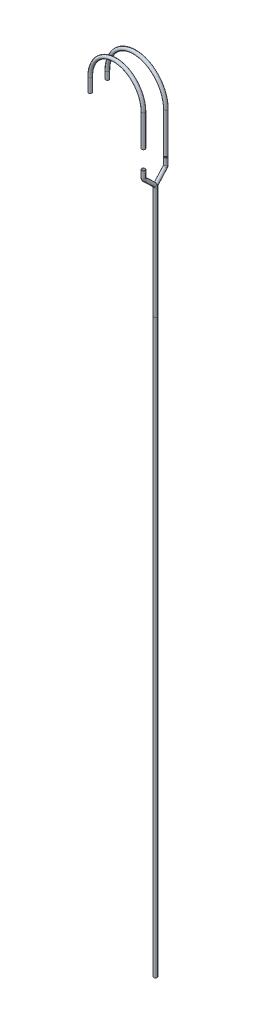
ISO-10303-21;
HEADER;
FILE_DESCRIPTION(('STEP AP214'),'2;1');
FILE_NAME('part.step','',(''),(''),'','','');
FILE_SCHEMA(('AUTOMOTIVE_DESIGN { 1 0 10303 214 1 1 1 1 }'));
ENDSEC;
DATA;
#1=APPLICATION_CONTEXT('core data for automotive mechanical design processes');
#2=APPLICATION_PROTOCOL_DEFINITION('international standard','automotive_design',2000,#1);
#3=PRODUCT_CONTEXT('',#1,'mechanical');
#4=PRODUCT('Part','Part','',(#3));
#5=PRODUCT_RELATED_PRODUCT_CATEGORY('part','',(#4));
#6=PRODUCT_DEFINITION_FORMATION('','',#4);
#7=PRODUCT_DEFINITION_CONTEXT('part definition',#1,'design');
#8=PRODUCT_DEFINITION('design','',#6,#7);
#9=PRODUCT_DEFINITION_SHAPE('','',#8);
#10=(LENGTH_UNIT() NAMED_UNIT(*) SI_UNIT(.MILLI.,.METRE.));
#11=(NAMED_UNIT(*) PLANE_ANGLE_UNIT() SI_UNIT($,.RADIAN.));
#12=(NAMED_UNIT(*) SI_UNIT($,.STERADIAN.) SOLID_ANGLE_UNIT());
#13=UNCERTAINTY_MEASURE_WITH_UNIT(LENGTH_MEASURE(1.E-05),#10,'distance_accuracy_value','');
#14=(GEOMETRIC_REPRESENTATION_CONTEXT(3) GLOBAL_UNCERTAINTY_ASSIGNED_CONTEXT((#13)) GLOBAL_UNIT_ASSIGNED_CONTEXT((#10,
#11,#12)) REPRESENTATION_CONTEXT('',''));
#15=CARTESIAN_POINT('',(0.,0.,0.));
#16=DIRECTION('',(0.,0.,1.));
#17=DIRECTION('',(1.,0.,0.));
#18=AXIS2_PLACEMENT_3D('',#15,#16,#17);
#19=CARTESIAN_POINT('',(-29328.0283187605,8249.09082358546,41599.5844884566));
#20=DIRECTION('',(0.,-1.,0.));
#21=DIRECTION('',(-0.138416963264837,0.,0.990374042612457));
#22=AXIS2_PLACEMENT_3D('',#19,#20,#21);
#23=PLANE('',#22);
#24=CARTESIAN_POINT('',(-29328.0283187605,8249.09082358546,41599.5844884566));
#25=DIRECTION('',(0.,-1.,0.));
#26=DIRECTION('',(0.,0.,-1.));
#27=AXIS2_PLACEMENT_3D('',#24,#25,#26);
#28=CIRCLE('',#27,27.0000000000011);
#29=CARTESIAN_POINT('',(-29328.0283187605,8249.09082358546,41572.5844884566));
#30=VERTEX_POINT('',#29);
#31=EDGE_CURVE('E123',#30,#30,#28,.T.);
#32=ORIENTED_EDGE('',*,*,#31,.F.);
#33=EDGE_LOOP('',(#32));
#34=FACE_BOUND('',#33,.T.);
#35=CARTESIAN_POINT('',(-29328.0283187605,8249.09082358546,41599.5844884566));
#36=DIRECTION('',(0.,-1.,0.));
#37=DIRECTION('',(-0.138416963264837,0.,0.990374042612457));
#38=AXIS2_PLACEMENT_3D('',#35,#36,#37);
#39=CIRCLE('',#38,30.0000000000011);
#40=CARTESIAN_POINT('',(-29332.1808276585,8249.09082358546,41629.295709735));
#41=VERTEX_POINT('',#40);
#42=EDGE_CURVE('E114',#41,#41,#39,.T.);
#43=ORIENTED_EDGE('',*,*,#42,.T.);
#44=EDGE_LOOP('',(#43));
#45=FACE_BOUND('',#44,.T.);
#46=ADVANCED_FACE('F100',(#34,#45),#23,.T.);
#47=CARTESIAN_POINT('',(-30449.0264801453,8827.27610677791,41521.6266986129));
#48=DIRECTION('',(0.,1.,0.));
#49=DIRECTION('',(0.,0.,1.));
#50=AXIS2_PLACEMENT_3D('',#47,#48,#49);
#51=PLANE('',#50);
#52=CARTESIAN_POINT('',(-30449.0264801453,8827.27610677791,41521.6266986129));
#53=DIRECTION('',(0.,1.,0.));
#54=DIRECTION('',(0.,0.,1.));
#55=AXIS2_PLACEMENT_3D('',#52,#53,#54);
#56=CIRCLE('',#55,27.0000000000011);
#57=CARTESIAN_POINT('',(-30449.0264801453,8827.27610677791,41548.6266986129));
#58=VERTEX_POINT('',#57);
#59=EDGE_CURVE('E119',#58,#58,#56,.T.);
#60=ORIENTED_EDGE('',*,*,#59,.T.);
#61=EDGE_LOOP('',(#60));
#62=FACE_BOUND('',#61,.T.);
#63=CARTESIAN_POINT('',(-30449.0264801453,8827.27610677791,41521.6266986129));
#64=DIRECTION('',(0.,1.,0.));
#65=DIRECTION('',(0.,0.,1.));
#66=AXIS2_PLACEMENT_3D('',#63,#64,#65);
#67=CIRCLE('',#66,30.0000000000011);
#68=CARTESIAN_POINT('',(-30449.0264801453,8827.27610677791,41551.6266986129));
#69=VERTEX_POINT('',#68);
#70=EDGE_CURVE('E12',#69,#69,#67,.T.);
#71=ORIENTED_EDGE('',*,*,#70,.F.);
#72=EDGE_LOOP('',(#71));
#73=FACE_BOUND('',#72,.T.);
#74=ADVANCED_FACE('F143',(#62,#73),#51,.F.);
#75=CARTESIAN_POINT('',(-29328.0283187605,8249.09082358546,41599.5844884566));
#76=DIRECTION('',(0.,1.,0.));
#77=DIRECTION('',(0.,0.,1.));
#78=AXIS2_PLACEMENT_3D('',#75,#76,#77);
#79=CYLINDRICAL_SURFACE('',#78,30.0000000000011);
#80=CARTESIAN_POINT('',(-29328.0283187605,8963.28672199971,41599.5844884566));
#81=DIRECTION('',(0.,-1.,0.));
#82=DIRECTION('',(-0.138416963264837,0.,0.990374042612457));
#83=AXIS2_PLACEMENT_3D('',#80,#81,#82);
#84=CIRCLE('',#83,30.0000000000011);
#85=CARTESIAN_POINT('',(-29298.1006005184,8963.28672199971,41601.6657574984));
#86=VERTEX_POINT('',#85);
#87=EDGE_CURVE('E110',#86,#86,#84,.T.);
#88=ORIENTED_EDGE('',*,*,#87,.T.);
#89=EDGE_LOOP('',(#88));
#90=FACE_BOUND('',#89,.T.);
#91=ORIENTED_EDGE('',*,*,#42,.F.);
#92=EDGE_LOOP('',(#91));
#93=FACE_BOUND('',#92,.T.);
#94=ADVANCED_FACE('F147',(#90,#93),#79,.T.);
#95=CARTESIAN_POINT('',(-29888.5273994529,8963.28672199971,41560.6055935347));
#96=DIRECTION('',(-0.069375634726981,0.,0.997590608068374));
#97=DIRECTION('',(0.997590608068374,0.,0.069375634726981));
#98=AXIS2_PLACEMENT_3D('',#95,#96,#97);
#99=TOROIDAL_SURFACE('',#98,561.852804305876,30.0000000000011);
#100=CARTESIAN_POINT('',(-30449.0264801453,8963.28672199971,41521.6266986129));
#101=DIRECTION('',(0.,1.,0.));
#102=DIRECTION('',(0.,0.,1.));
#103=AXIS2_PLACEMENT_3D('',#100,#101,#102);
#104=CIRCLE('',#103,30.0000000000011);
#105=CARTESIAN_POINT('',(-30478.9541983874,8963.28672199971,41519.5454295711));
#106=VERTEX_POINT('',#105);
#107=EDGE_CURVE('E106',#106,#106,#104,.T.);
#108=CARTESIAN_POINT('',(-29888.5273994529,8963.28672199971,41560.6055935347));
#109=DIRECTION('',(-0.069375634726981,0.,0.997590608068374));
#110=DIRECTION('',(0.997590608068374,0.,0.069375634726981));
#111=AXIS2_PLACEMENT_3D('',#108,#109,#110);
#112=CIRCLE('',#111,591.852804305877);
#113=EDGE_CURVE('',#86,#106,#112,.T.);
#114=ORIENTED_EDGE('',*,*,#87,.F.);
#115=ORIENTED_EDGE('',*,*,#107,.T.);
#116=ORIENTED_EDGE('',*,*,#113,.T.);
#117=ORIENTED_EDGE('',*,*,#113,.F.);
#118=EDGE_LOOP('',(#114,#116,#115,#117));
#119=FACE_BOUND('',#118,.T.);
#120=ADVANCED_FACE('F149',(#119),#99,.T.);
#121=CARTESIAN_POINT('',(-30449.0264801453,8963.28672199971,41521.6266986129));
#122=DIRECTION('',(0.,-1.,0.));
#123=DIRECTION('',(0.,0.,-1.));
#124=AXIS2_PLACEMENT_3D('',#121,#122,#123);
#125=CYLINDRICAL_SURFACE('',#124,30.0000000000011);
#126=ORIENTED_EDGE('',*,*,#70,.T.);
#127=EDGE_LOOP('',(#126));
#128=FACE_BOUND('',#127,.T.);
#129=ORIENTED_EDGE('',*,*,#107,.F.);
#130=EDGE_LOOP('',(#129));
#131=FACE_BOUND('',#130,.T.);
#132=ADVANCED_FACE('F137',(#128,#131),#125,.T.);
#133=CARTESIAN_POINT('',(-29328.0283187605,8249.09082358546,41599.5844884566));
#134=DIRECTION('',(0.,1.,0.));
#135=DIRECTION('',(0.,0.,1.));
#136=AXIS2_PLACEMENT_3D('',#133,#134,#135);
#137=CYLINDRICAL_SURFACE('',#136,27.0000000000011);
#138=CARTESIAN_POINT('',(-29328.0283187605,8963.28672199971,41599.5844884566));
#139=DIRECTION('',(0.,1.,0.));
#140=DIRECTION('',(0.,0.,1.));
#141=AXIS2_PLACEMENT_3D('',#138,#139,#140);
#142=CIRCLE('',#141,27.0000000000011);
#143=CARTESIAN_POINT('',(-29301.0933723427,8963.28672199971,41601.4576305942));
#144=VERTEX_POINT('',#143);
#145=EDGE_CURVE('E126',#144,#144,#142,.F.);
#146=ORIENTED_EDGE('',*,*,#145,.F.);
#147=EDGE_LOOP('',(#146));
#148=FACE_BOUND('',#147,.T.);
#149=ORIENTED_EDGE('',*,*,#31,.T.);
#150=EDGE_LOOP('',(#149));
#151=FACE_BOUND('',#150,.T.);
#152=ADVANCED_FACE('F134',(#148,#151),#137,.F.);
#153=CARTESIAN_POINT('',(-29888.5273994529,8963.28672199971,41560.6055935347));
#154=DIRECTION('',(-0.069375634726981,0.,0.997590608068374));
#155=DIRECTION('',(0.997590608068374,0.,0.069375634726981));
#156=AXIS2_PLACEMENT_3D('',#153,#154,#155);
#157=TOROIDAL_SURFACE('',#156,561.852804305876,27.0000000000011);
#158=CARTESIAN_POINT('',(-30449.0264801453,8963.28672199971,41521.6266986129));
#159=DIRECTION('',(0.,1.,0.));
#160=DIRECTION('',(-1.,0.,0.));
#161=AXIS2_PLACEMENT_3D('',#158,#159,#160);
#162=CIRCLE('',#161,27.0000000000011);
#163=CARTESIAN_POINT('',(-30475.9614265632,8963.28672199971,41519.7535564752));
#164=VERTEX_POINT('',#163);
#165=EDGE_CURVE('E122',#164,#164,#162,.T.);
#166=CARTESIAN_POINT('',(-29888.5273994529,8963.28672199971,41560.6055935347));
#167=DIRECTION('',(-0.069375634726981,0.,0.997590608068374));
#168=DIRECTION('',(0.997590608068374,0.,0.069375634726981));
#169=AXIS2_PLACEMENT_3D('',#166,#167,#168);
#170=CIRCLE('',#169,588.852804305877);
#171=EDGE_CURVE('',#144,#164,#170,.T.);
#172=ORIENTED_EDGE('',*,*,#145,.T.);
#173=ORIENTED_EDGE('',*,*,#165,.F.);
#174=ORIENTED_EDGE('',*,*,#171,.T.);
#175=ORIENTED_EDGE('',*,*,#171,.F.);
#176=EDGE_LOOP('',(#172,#174,#173,#175));
#177=FACE_BOUND('',#176,.T.);
#178=ADVANCED_FACE('F132',(#177),#157,.F.);
#179=CARTESIAN_POINT('',(-30449.0264801453,8963.28672199971,41521.6266986129));
#180=DIRECTION('',(0.,-1.,0.));
#181=DIRECTION('',(0.,0.,-1.));
#182=AXIS2_PLACEMENT_3D('',#179,#180,#181);
#183=CYLINDRICAL_SURFACE('',#182,27.0000000000011);
#184=ORIENTED_EDGE('',*,*,#59,.F.);
#185=EDGE_LOOP('',(#184));
#186=FACE_BOUND('',#185,.T.);
#187=ORIENTED_EDGE('',*,*,#165,.T.);
#188=EDGE_LOOP('',(#187));
#189=FACE_BOUND('',#188,.T.);
#190=ADVANCED_FACE('F144',(#186,#189),#183,.F.);
#191=CLOSED_SHELL('',(#46,#74,#94,#120,#132,#152,#178,#190));
#192=MANIFOLD_SOLID_BREP('B2',#191);
#193=CARTESIAN_POINT('',(-29328.0283187605,8554.23850203513,41998.8335954096));
#194=DIRECTION('',(0.,-1.,0.));
#195=DIRECTION('',(0.990557061922177,0.,0.137101083424256));
#196=AXIS2_PLACEMENT_3D('',#193,#194,#195);
#197=PLANE('',#196);
#198=CARTESIAN_POINT('',(-29328.0283187605,8554.23850203513,41998.8335954096));
#199=DIRECTION('',(0.,-1.,0.));
#200=DIRECTION('',(1.,0.,0.));
#201=AXIS2_PLACEMENT_3D('',#198,#199,#200);
#202=CIRCLE('',#201,27.0000000000011);
#203=CARTESIAN_POINT('',(-29301.0283187605,8554.23850203513,41998.8335954096));
#204=VERTEX_POINT('',#203);
#205=EDGE_CURVE('E269',#204,#204,#202,.T.);
#206=ORIENTED_EDGE('',*,*,#205,.F.);
#207=EDGE_LOOP('',(#206));
#208=FACE_BOUND('',#207,.T.);
#209=CARTESIAN_POINT('',(-29328.0283187605,8554.23850203513,41998.8335954096));
#210=DIRECTION('',(0.,-1.,0.));
#211=DIRECTION('',(0.990557061922177,0.,0.137101083424256));
#212=AXIS2_PLACEMENT_3D('',#209,#210,#211);
#213=CIRCLE('',#212,30.0000000000011);
#214=CARTESIAN_POINT('',(-29298.3116069028,8554.23850203513,42002.9466279124));
#215=VERTEX_POINT('',#214);
#216=EDGE_CURVE('E260',#215,#215,#213,.T.);
#217=ORIENTED_EDGE('',*,*,#216,.T.);
#218=EDGE_LOOP('',(#217));
#219=FACE_BOUND('',#218,.T.);
#220=ADVANCED_FACE('F246',(#208,#219),#197,.T.);
#221=CARTESIAN_POINT('',(-30348.5713885513,8877.04012121745,41928.5429399818));
#222=DIRECTION('',(1.10862689605089E-12,1.,5.54313448025443E-13));
#223=DIRECTION('',(-1.,1.10862689605089E-12,0.));
#224=AXIS2_PLACEMENT_3D('',#221,#222,#223);
#225=PLANE('',#224);
#226=CARTESIAN_POINT('',(-30348.5713885513,8877.04012121745,41928.5429399818));
#227=DIRECTION('',(1.10862689605089E-12,1.,5.54313448025443E-13));
#228=DIRECTION('',(-1.,1.10862689605089E-12,0.));
#229=AXIS2_PLACEMENT_3D('',#226,#227,#228);
#230=CIRCLE('',#229,27.0000000000011);
#231=CARTESIAN_POINT('',(-30375.5713885513,8877.04012121748,41928.5429399818));
#232=VERTEX_POINT('',#231);
#233=EDGE_CURVE('E265',#232,#232,#230,.T.);
#234=ORIENTED_EDGE('',*,*,#233,.T.);
#235=EDGE_LOOP('',(#234));
#236=FACE_BOUND('',#235,.T.);
#237=CARTESIAN_POINT('',(-30348.5713885513,8877.04012121745,41928.5429399818));
#238=DIRECTION('',(1.10862689605089E-12,1.,5.54313448025443E-13));
#239=DIRECTION('',(-1.,1.10862689605089E-12,0.));
#240=AXIS2_PLACEMENT_3D('',#237,#238,#239);
#241=CIRCLE('',#240,30.0000000000011);
#242=CARTESIAN_POINT('',(-30378.5713885513,8877.04012121749,41928.5429399818));
#243=VERTEX_POINT('',#242);
#244=EDGE_CURVE('E99',#243,#243,#241,.T.);
#245=ORIENTED_EDGE('',*,*,#244,.F.);
#246=EDGE_LOOP('',(#245));
#247=FACE_BOUND('',#246,.T.);
#248=ADVANCED_FACE('F289',(#236,#247),#225,.F.);
#249=CARTESIAN_POINT('',(-29328.0283187605,8554.23850203513,41998.8335954096));
#250=DIRECTION('',(0.,1.,0.));
#251=DIRECTION('',(0.,0.,1.));
#252=AXIS2_PLACEMENT_3D('',#249,#250,#251);
#253=CYLINDRICAL_SURFACE('',#252,30.0000000000011);
#254=CARTESIAN_POINT('',(-29328.0283187605,9119.91561055123,41998.8335954096));
#255=DIRECTION('',(0.,-1.,0.));
#256=DIRECTION('',(0.990557061922177,0.,0.137101083424256));
#257=AXIS2_PLACEMENT_3D('',#254,#255,#256);
#258=CIRCLE('',#257,30.0000000000011);
#259=CARTESIAN_POINT('',(-29298.09922459,9119.91561055122,42000.8949838095));
#260=VERTEX_POINT('',#259);
#261=EDGE_CURVE('E256',#260,#260,#258,.T.);
#262=ORIENTED_EDGE('',*,*,#261,.T.);
#263=EDGE_LOOP('',(#262));
#264=FACE_BOUND('',#263,.T.);
#265=ORIENTED_EDGE('',*,*,#216,.F.);
#266=EDGE_LOOP('',(#265));
#267=FACE_BOUND('',#266,.T.);
#268=ADVANCED_FACE('F293',(#264,#267),#253,.T.);
#269=CARTESIAN_POINT('',(-29838.2998536558,9119.91561055125,41963.6882676958));
#270=DIRECTION('',(-0.0687129466615399,-4.93161917641324E-13,0.997636472349066));
#271=DIRECTION('',(0.997636472349066,0.,0.0687129466615399));
#272=AXIS2_PLACEMENT_3D('',#269,#270,#271);
#273=TOROIDAL_SURFACE('',#272,511.480433041648,30.0000000000011);
#274=CARTESIAN_POINT('',(-30348.5713885409,9119.9156105832,41928.5429399823));
#275=DIRECTION('',(1.10862689605089E-12,1.,5.54313448025443E-13));
#276=DIRECTION('',(-1.,1.10862689605089E-12,0.));
#277=AXIS2_PLACEMENT_3D('',#274,#275,#276);
#278=CIRCLE('',#277,30.0000000000011);
#279=CARTESIAN_POINT('',(-30378.5004827215,9119.91561058507,41926.4815515818));
#280=VERTEX_POINT('',#279);
#281=EDGE_CURVE('E252',#280,#280,#278,.T.);
#282=CARTESIAN_POINT('',(-29838.2998536558,9119.91561055125,41963.6882676958));
#283=DIRECTION('',(-0.0687129466615399,-4.93161917641324E-13,0.997636472349066));
#284=DIRECTION('',(0.997636472349066,0.,0.0687129466615399));
#285=AXIS2_PLACEMENT_3D('',#282,#283,#284);
#286=CIRCLE('',#285,541.480433041649);
#287=EDGE_CURVE('',#260,#280,#286,.T.);
#288=ORIENTED_EDGE('',*,*,#261,.F.);
#289=ORIENTED_EDGE('',*,*,#281,.T.);
#290=ORIENTED_EDGE('',*,*,#287,.T.);
#291=ORIENTED_EDGE('',*,*,#287,.F.);
#292=EDGE_LOOP('',(#288,#290,#289,#291));
#293=FACE_BOUND('',#292,.T.);
#294=ADVANCED_FACE('F295',(#293),#273,.T.);
#295=CARTESIAN_POINT('',(-30348.571388551,9119.91561055127,41928.5429399819));
#296=DIRECTION('',(-1.14096184718569E-12,-1.,-5.55853207603285E-13));
#297=DIRECTION('',(1.,-1.14096184718569E-12,0.));
#298=AXIS2_PLACEMENT_3D('',#295,#296,#297);
#299=CYLINDRICAL_SURFACE('',#298,30.0000000000011);
#300=ORIENTED_EDGE('',*,*,#244,.T.);
#301=EDGE_LOOP('',(#300));
#302=FACE_BOUND('',#301,.T.);
#303=ORIENTED_EDGE('',*,*,#281,.F.);
#304=EDGE_LOOP('',(#303));
#305=FACE_BOUND('',#304,.T.);
#306=ADVANCED_FACE('F283',(#302,#305),#299,.T.);
#307=CARTESIAN_POINT('',(-29328.0283187605,8554.23850203513,41998.8335954096));
#308=DIRECTION('',(0.,1.,0.));
#309=DIRECTION('',(0.,0.,1.));
#310=AXIS2_PLACEMENT_3D('',#307,#308,#309);
#311=CYLINDRICAL_SURFACE('',#310,27.0000000000011);
#312=CARTESIAN_POINT('',(-29328.0283187605,9119.91561055123,41998.8335954096));
#313=DIRECTION('',(0.,1.,0.));
#314=DIRECTION('',(0.,0.,1.));
#315=AXIS2_PLACEMENT_3D('',#312,#313,#314);
#316=CIRCLE('',#315,27.0000000000011);
#317=CARTESIAN_POINT('',(-29301.0921340071,9119.91561055123,42000.6888449695));
#318=VERTEX_POINT('',#317);
#319=EDGE_CURVE('E272',#318,#318,#316,.F.);
#320=ORIENTED_EDGE('',*,*,#319,.F.);
#321=EDGE_LOOP('',(#320));
#322=FACE_BOUND('',#321,.T.);
#323=ORIENTED_EDGE('',*,*,#205,.T.);
#324=EDGE_LOOP('',(#323));
#325=FACE_BOUND('',#324,.T.);
#326=ADVANCED_FACE('F280',(#322,#325),#311,.F.);
#327=CARTESIAN_POINT('',(-29838.2998536558,9119.91561055125,41963.6882676958));
#328=DIRECTION('',(-0.0687129466615399,-4.93161917641324E-13,0.997636472349066));
#329=DIRECTION('',(0.997636472349066,0.,0.0687129466615399));
#330=AXIS2_PLACEMENT_3D('',#327,#328,#329);
#331=TOROIDAL_SURFACE('',#330,511.480433041648,27.0000000000011);
#332=CARTESIAN_POINT('',(-30348.571388551,9119.9156105832,41928.5429399819));
#333=DIRECTION('',(-1.14096184718569E-12,-1.,-5.55853207603285E-13));
#334=DIRECTION('',(1.,-1.14096184718569E-12,0.));
#335=AXIS2_PLACEMENT_3D('',#332,#333,#334);
#336=CIRCLE('',#335,27.0000000000011);
#337=CARTESIAN_POINT('',(-30375.5075733044,9119.91561058489,41926.687690422));
#338=VERTEX_POINT('',#337);
#339=EDGE_CURVE('E268',#338,#338,#336,.F.);
#340=CARTESIAN_POINT('',(-29838.2998536558,9119.91561055125,41963.6882676958));
#341=DIRECTION('',(-0.0687129466615399,-4.93161917641324E-13,0.997636472349066));
#342=DIRECTION('',(0.997636472349066,0.,0.0687129466615399));
#343=AXIS2_PLACEMENT_3D('',#340,#341,#342);
#344=CIRCLE('',#343,538.480433041649);
#345=EDGE_CURVE('',#318,#338,#344,.T.);
#346=ORIENTED_EDGE('',*,*,#319,.T.);
#347=ORIENTED_EDGE('',*,*,#339,.F.);
#348=ORIENTED_EDGE('',*,*,#345,.T.);
#349=ORIENTED_EDGE('',*,*,#345,.F.);
#350=EDGE_LOOP('',(#346,#348,#347,#349));
#351=FACE_BOUND('',#350,.T.);
#352=ADVANCED_FACE('F278',(#351),#331,.F.);
#353=CARTESIAN_POINT('',(-30348.571388551,9119.91561055127,41928.5429399819));
#354=DIRECTION('',(-1.14096184718569E-12,-1.,-5.55853207603285E-13));
#355=DIRECTION('',(1.,-1.14096184718569E-12,0.));
#356=AXIS2_PLACEMENT_3D('',#353,#354,#355);
#357=CYLINDRICAL_SURFACE('',#356,27.0000000000011);
#358=ORIENTED_EDGE('',*,*,#233,.F.);
#359=EDGE_LOOP('',(#358));
#360=FACE_BOUND('',#359,.T.);
#361=ORIENTED_EDGE('',*,*,#339,.T.);
#362=EDGE_LOOP('',(#361));
#363=FACE_BOUND('',#362,.T.);
#364=ADVANCED_FACE('F290',(#360,#363),#357,.F.);
#365=CLOSED_SHELL('',(#220,#248,#268,#294,#306,#326,#352,#364));
#366=MANIFOLD_SOLID_BREP('B7',#365);
#367=CARTESIAN_POINT('',(-29315.9121489755,5869.93294843319,41797.5421626085));
#368=DIRECTION('',(0.,-1.,0.));
#369=DIRECTION('',(0.,0.,-1.));
#370=AXIS2_PLACEMENT_3D('',#367,#368,#369);
#371=PLANE('',#370);
#372=CARTESIAN_POINT('',(-29315.9121489755,5869.93294843319,41797.5421626085));
#373=DIRECTION('',(0.,-1.,0.));
#374=DIRECTION('',(0.,0.,-1.));
#375=AXIS2_PLACEMENT_3D('',#372,#373,#374);
#376=CIRCLE('',#375,27.0000000000011);
#377=CARTESIAN_POINT('',(-29315.9121489755,5869.93294843319,41770.5421626085));
#378=VERTEX_POINT('',#377);
#379=EDGE_CURVE('E421',#378,#378,#376,.T.);
#380=ORIENTED_EDGE('',*,*,#379,.F.);
#381=EDGE_LOOP('',(#380));
#382=FACE_BOUND('',#381,.T.);
#383=CARTESIAN_POINT('',(-29315.9121489755,5869.93294843319,41797.5421626085));
#384=DIRECTION('',(0.,-1.,0.));
#385=DIRECTION('',(0.,0.,-1.));
#386=AXIS2_PLACEMENT_3D('',#383,#384,#385);
#387=CIRCLE('',#386,30.0000000000011);
#388=CARTESIAN_POINT('',(-29315.9121489755,5869.93294843319,41767.5421626085));
#389=VERTEX_POINT('',#388);
#390=EDGE_CURVE('E414',#389,#389,#387,.T.);
#391=ORIENTED_EDGE('',*,*,#390,.T.);
#392=EDGE_LOOP('',(#391));
#393=FACE_BOUND('',#392,.T.);
#394=ADVANCED_FACE('F392',(#382,#393),#371,.T.);
#395=CARTESIAN_POINT('',(-29328.0283187605,8229.22146286782,41599.5844884566));
#396=DIRECTION('',(0.,-1.,0.));
#397=DIRECTION('',(0.,0.,-1.));
#398=AXIS2_PLACEMENT_3D('',#395,#396,#397);
#399=PLANE('',#398);
#400=CARTESIAN_POINT('',(-29328.0283187605,8229.22146286782,41599.5844884566));
#401=DIRECTION('',(0.,-1.,0.));
#402=DIRECTION('',(0.,0.,-1.));
#403=AXIS2_PLACEMENT_3D('',#400,#401,#402);
#404=CIRCLE('',#403,27.0000000000011);
#405=CARTESIAN_POINT('',(-29328.0283187605,8229.22146286782,41572.5844884566));
#406=VERTEX_POINT('',#405);
#407=EDGE_CURVE('E417',#406,#406,#404,.T.);
#408=ORIENTED_EDGE('',*,*,#407,.T.);
#409=EDGE_LOOP('',(#408));
#410=FACE_BOUND('',#409,.T.);
#411=CARTESIAN_POINT('',(-29328.0283187605,8229.22146286782,41599.5844884566));
#412=DIRECTION('',(0.,-1.,0.));
#413=DIRECTION('',(0.,0.,-1.));
#414=AXIS2_PLACEMENT_3D('',#411,#412,#413);
#415=CIRCLE('',#414,30.0000000000011);
#416=CARTESIAN_POINT('',(-29328.0283187605,8229.22146286782,41569.5844884566));
#417=VERTEX_POINT('',#416);
#418=EDGE_CURVE('E245',#417,#417,#415,.T.);
#419=ORIENTED_EDGE('',*,*,#418,.F.);
#420=EDGE_LOOP('',(#419));
#421=FACE_BOUND('',#420,.T.);
#422=ADVANCED_FACE('F447',(#410,#421),#399,.F.);
#423=CARTESIAN_POINT('',(-29315.9121489755,5869.93294843319,41797.5421626085));
#424=DIRECTION('',(-1.72306613421824E-13,1.,0.));
#425=DIRECTION('',(-1.,-1.72306613421824E-13,0.));
#426=AXIS2_PLACEMENT_3D('',#423,#424,#425);
#427=CYLINDRICAL_SURFACE('',#426,30.0000000000011);
#428=CARTESIAN_POINT('',(-29315.9121489758,7869.93294843319,41797.5421626083));
#429=DIRECTION('',(0.,-1.,0.));
#430=DIRECTION('',(0.,0.,-1.));
#431=AXIS2_PLACEMENT_3D('',#428,#429,#430);
#432=CIRCLE('',#431,30.0000000000011);
#433=CARTESIAN_POINT('',(-29314.0794028298,7869.93294843392,41827.486127635));
#434=VERTEX_POINT('',#433);
#435=EDGE_CURVE('E411',#434,#434,#432,.T.);
#436=ORIENTED_EDGE('',*,*,#435,.T.);
#437=EDGE_LOOP('',(#436));
#438=FACE_BOUND('',#437,.T.);
#439=ORIENTED_EDGE('',*,*,#390,.F.);
#440=EDGE_LOOP('',(#439));
#441=FACE_BOUND('',#440,.T.);
#442=ADVANCED_FACE('F451',(#438,#441),#427,.T.);
#443=CARTESIAN_POINT('',(-29318.966725886,7869.93294843198,41747.6355542285));
#444=DIRECTION('',(-0.998132167582335,0.,0.0610915381815685));
#445=DIRECTION('',(0.0610915381815685,0.,0.998132167582335));
#446=AXIS2_PLACEMENT_3D('',#443,#444,#445);
#447=TOROIDAL_SURFACE('',#446,50.0000000000414,30.0000000000011);
#448=CARTESIAN_POINT('',(-29316.8068138401,7905.28828749124,41782.9248554393));
#449=DIRECTION('',(0.0431982409213028,-0.707106781186567,0.705786024217877));
#450=DIRECTION('',(0.0178598755795864,-0.705786024217877,-0.708199910239336));
#451=AXIS2_PLACEMENT_3D('',#448,#449,#450);
#452=CIRCLE('',#451,30.0000000000011);
#453=CARTESIAN_POINT('',(-29315.5108666126,7926.50149092693,41804.0984361659));
#454=VERTEX_POINT('',#453);
#455=EDGE_CURVE('E406',#454,#454,#452,.T.);
#456=CARTESIAN_POINT('',(-29318.966725886,7869.93294843198,41747.6355542285));
#457=DIRECTION('',(-0.998132167582335,0.,0.0610915381815685));
#458=DIRECTION('',(0.0610915381815685,0.,0.998132167582335));
#459=AXIS2_PLACEMENT_3D('',#456,#457,#458);
#460=CIRCLE('',#459,80.0000000000425);
#461=EDGE_CURVE('',#434,#454,#460,.T.);
#462=ORIENTED_EDGE('',*,*,#435,.F.);
#463=ORIENTED_EDGE('',*,*,#455,.T.);
#464=ORIENTED_EDGE('',*,*,#461,.T.);
#465=ORIENTED_EDGE('',*,*,#461,.F.);
#466=EDGE_LOOP('',(#462,#464,#463,#465));
#467=FACE_BOUND('',#466,.T.);
#468=ADVANCED_FACE('F453',(#467),#447,.T.);
#469=CARTESIAN_POINT('',(-29316.8068138401,7905.28828749132,41782.9248554394));
#470=DIRECTION('',(-0.0431982409213269,0.707106781186548,-0.705786024217895));
#471=DIRECTION('',(0.,0.706445476730657,0.707767467751093));
#472=AXIS2_PLACEMENT_3D('',#469,#470,#471);
#473=CYLINDRICAL_SURFACE('',#472,30.0000000000011);
#474=CARTESIAN_POINT('',(-29327.1336538975,8074.32708344882,41614.2017956248));
#475=DIRECTION('',(0.0431982409213268,-0.707106781186548,0.705786024217895));
#476=DIRECTION('',(0.0178598755795875,-0.705786024217895,-0.708199910239318));
#477=AXIS2_PLACEMENT_3D('',#474,#475,#476);
#478=CIRCLE('',#477,30.0000000000011);
#479=CARTESIAN_POINT('',(-29328.4296011251,8053.11388001322,41593.0282148983));
#480=VERTEX_POINT('',#479);
#481=EDGE_CURVE('E402',#480,#480,#478,.T.);
#482=ORIENTED_EDGE('',*,*,#481,.T.);
#483=EDGE_LOOP('',(#482));
#484=FACE_BOUND('',#483,.T.);
#485=ORIENTED_EDGE('',*,*,#455,.F.);
#486=EDGE_LOOP('',(#485));
#487=FACE_BOUND('',#486,.T.);
#488=ADVANCED_FACE('F460',(#484,#487),#473,.T.);
#489=CARTESIAN_POINT('',(-29324.9737418514,8109.68242250814,41649.4910968357));
#490=DIRECTION('',(0.998132167582334,0.,-0.0610915381815844));
#491=DIRECTION('',(-0.0610915381815845,0.,-0.998132167582334));
#492=AXIS2_PLACEMENT_3D('',#489,#490,#491);
#493=TOROIDAL_SURFACE('',#492,49.999999999995,30.0000000000011);
#494=CARTESIAN_POINT('',(-29328.0283187605,8109.68242250814,41599.5844884566));
#495=DIRECTION('',(0.,-1.,0.));
#496=DIRECTION('',(0.,0.,-1.));
#497=AXIS2_PLACEMENT_3D('',#494,#495,#496);
#498=CIRCLE('',#497,30.0000000000011);
#499=CARTESIAN_POINT('',(-29329.861064906,8109.68242250814,41569.6405234291));
#500=VERTEX_POINT('',#499);
#501=EDGE_CURVE('E398',#500,#500,#498,.T.);
#502=CARTESIAN_POINT('',(-29324.9737418514,8109.68242250814,41649.4910968357));
#503=DIRECTION('',(0.998132167582334,0.,-0.0610915381815844));
#504=DIRECTION('',(-0.0610915381815845,0.,-0.998132167582334));
#505=AXIS2_PLACEMENT_3D('',#502,#503,#504);
#506=CIRCLE('',#505,79.9999999999962);
#507=EDGE_CURVE('',#480,#500,#506,.T.);
#508=ORIENTED_EDGE('',*,*,#481,.F.);
#509=ORIENTED_EDGE('',*,*,#501,.T.);
#510=ORIENTED_EDGE('',*,*,#507,.T.);
#511=ORIENTED_EDGE('',*,*,#507,.F.);
#512=EDGE_LOOP('',(#508,#510,#509,#511));
#513=FACE_BOUND('',#512,.T.);
#514=ADVANCED_FACE('F466',(#513),#493,.T.);
#515=CARTESIAN_POINT('',(-29328.0283187605,8109.68242250814,41599.5844884566));
#516=DIRECTION('',(0.,1.,0.));
#517=DIRECTION('',(0.,0.,1.));
#518=AXIS2_PLACEMENT_3D('',#515,#516,#517);
#519=CYLINDRICAL_SURFACE('',#518,30.0000000000011);
#520=ORIENTED_EDGE('',*,*,#418,.T.);
#521=EDGE_LOOP('',(#520));
#522=FACE_BOUND('',#521,.T.);
#523=ORIENTED_EDGE('',*,*,#501,.F.);
#524=EDGE_LOOP('',(#523));
#525=FACE_BOUND('',#524,.T.);
#526=ADVANCED_FACE('F441',(#522,#525),#519,.T.);
#527=CARTESIAN_POINT('',(-29315.9121489755,5869.93294843319,41797.5421626085));
#528=DIRECTION('',(-1.72306613421824E-13,1.,0.));
#529=DIRECTION('',(-1.,-1.72306613421824E-13,0.));
#530=AXIS2_PLACEMENT_3D('',#527,#528,#529);
#531=CYLINDRICAL_SURFACE('',#530,27.0000000000011);
#532=CARTESIAN_POINT('',(-29315.9121489758,7869.9329484332,41797.5421626083));
#533=DIRECTION('',(-1.72306613421824E-13,1.,0.));
#534=DIRECTION('',(-1.,-1.72306613421824E-13,0.));
#535=AXIS2_PLACEMENT_3D('',#532,#533,#534);
#536=CIRCLE('',#535,27.0000000000011);
#537=CARTESIAN_POINT('',(-29314.2626774444,7869.93294843385,41824.4917311322));
#538=VERTEX_POINT('',#537);
#539=EDGE_CURVE('E424',#538,#538,#536,.F.);
#540=ORIENTED_EDGE('',*,*,#539,.F.);
#541=EDGE_LOOP('',(#540));
#542=FACE_BOUND('',#541,.T.);
#543=ORIENTED_EDGE('',*,*,#379,.T.);
#544=EDGE_LOOP('',(#543));
#545=FACE_BOUND('',#544,.T.);
#546=ADVANCED_FACE('F438',(#542,#545),#531,.F.);
#547=CARTESIAN_POINT('',(-29318.966725886,7869.93294843198,41747.6355542285));
#548=DIRECTION('',(-0.998132167582335,0.,0.0610915381815685));
#549=DIRECTION('',(0.0610915381815685,0.,0.998132167582335));
#550=AXIS2_PLACEMENT_3D('',#547,#548,#549);
#551=TOROIDAL_SURFACE('',#550,50.0000000000414,27.0000000000011);
#552=CARTESIAN_POINT('',(-29316.8068138399,7905.28828749134,41782.9248554394));
#553=DIRECTION('',(0.0431982409213015,-0.707106781186589,0.705786024217855));
#554=DIRECTION('',(0.,-0.706445476730617,-0.707767467751133));
#555=AXIS2_PLACEMENT_3D('',#552,#553,#554);
#556=CIRCLE('',#555,27.0000000000011);
#557=CARTESIAN_POINT('',(-29315.640461335,7924.38017058338,41801.9810780933));
#558=VERTEX_POINT('',#557);
#559=EDGE_CURVE('E430',#558,#558,#556,.T.);
#560=CARTESIAN_POINT('',(-29318.966725886,7869.93294843198,41747.6355542285));
#561=DIRECTION('',(-0.998132167582335,0.,0.0610915381815685));
#562=DIRECTION('',(0.0610915381815685,0.,0.998132167582335));
#563=AXIS2_PLACEMENT_3D('',#560,#561,#562);
#564=CIRCLE('',#563,77.0000000000425);
#565=EDGE_CURVE('',#538,#558,#564,.T.);
#566=ORIENTED_EDGE('',*,*,#539,.T.);
#567=ORIENTED_EDGE('',*,*,#559,.F.);
#568=ORIENTED_EDGE('',*,*,#565,.T.);
#569=ORIENTED_EDGE('',*,*,#565,.F.);
#570=EDGE_LOOP('',(#566,#568,#567,#569));
#571=FACE_BOUND('',#570,.T.);
#572=ADVANCED_FACE('F436',(#571),#551,.F.);
#573=CARTESIAN_POINT('',(-29316.8068138401,7905.28828749132,41782.9248554394));
#574=DIRECTION('',(-0.0431982409213269,0.707106781186548,-0.705786024217895));
#575=DIRECTION('',(0.,0.706445476730657,0.707767467751093));
#576=AXIS2_PLACEMENT_3D('',#573,#574,#575);
#577=CYLINDRICAL_SURFACE('',#576,27.0000000000011);
#578=CARTESIAN_POINT('',(-29327.1336538975,8074.32708344882,41614.2017956248));
#579=DIRECTION('',(-0.0431982409213269,0.707106781186548,-0.705786024217895));
#580=DIRECTION('',(0.,0.706445476730657,0.707767467751093));
#581=AXIS2_PLACEMENT_3D('',#578,#579,#580);
#582=CIRCLE('',#581,27.0000000000011);
#583=CARTESIAN_POINT('',(-29328.3000064024,8055.23520035678,41595.1455729709));
#584=VERTEX_POINT('',#583);
#585=EDGE_CURVE('E427',#584,#584,#582,.F.);
#586=ORIENTED_EDGE('',*,*,#585,.F.);
#587=EDGE_LOOP('',(#586));
#588=FACE_BOUND('',#587,.T.);
#589=ORIENTED_EDGE('',*,*,#559,.T.);
#590=EDGE_LOOP('',(#589));
#591=FACE_BOUND('',#590,.T.);
#592=ADVANCED_FACE('F513',(#588,#591),#577,.F.);
#593=CARTESIAN_POINT('',(-29324.9737418514,8109.68242250814,41649.4910968357));
#594=DIRECTION('',(0.998132167582334,0.,-0.0610915381815844));
#595=DIRECTION('',(-0.0610915381815845,0.,-0.998132167582334));
#596=AXIS2_PLACEMENT_3D('',#593,#594,#595);
#597=TOROIDAL_SURFACE('',#596,49.999999999995,27.0000000000011);
#598=CARTESIAN_POINT('',(-29328.0283187605,8109.68242250814,41599.5844884566));
#599=DIRECTION('',(0.,-1.,0.));
#600=DIRECTION('',(0.,0.,-1.));
#601=AXIS2_PLACEMENT_3D('',#598,#599,#600);
#602=CIRCLE('',#601,27.0000000000011);
#603=CARTESIAN_POINT('',(-29329.6777902914,8109.68242250814,41572.6349199319));
#604=VERTEX_POINT('',#603);
#605=EDGE_CURVE('E420',#604,#604,#602,.T.);
#606=CARTESIAN_POINT('',(-29324.9737418514,8109.68242250814,41649.4910968357));
#607=DIRECTION('',(0.998132167582334,0.,-0.0610915381815844));
#608=DIRECTION('',(-0.0610915381815845,0.,-0.998132167582334));
#609=AXIS2_PLACEMENT_3D('',#606,#607,#608);
#610=CIRCLE('',#609,76.9999999999962);
#611=EDGE_CURVE('',#584,#604,#610,.T.);
#612=ORIENTED_EDGE('',*,*,#585,.T.);
#613=ORIENTED_EDGE('',*,*,#605,.F.);
#614=ORIENTED_EDGE('',*,*,#611,.T.);
#615=ORIENTED_EDGE('',*,*,#611,.F.);
#616=EDGE_LOOP('',(#612,#614,#613,#615));
#617=FACE_BOUND('',#616,.T.);
#618=ADVANCED_FACE('F524',(#617),#597,.F.);
#619=CARTESIAN_POINT('',(-29328.0283187605,8109.68242250814,41599.5844884566));
#620=DIRECTION('',(0.,1.,0.));
#621=DIRECTION('',(0.,0.,1.));
#622=AXIS2_PLACEMENT_3D('',#619,#620,#621);
#623=CYLINDRICAL_SURFACE('',#622,27.0000000000011);
#624=ORIENTED_EDGE('',*,*,#407,.F.);
#625=EDGE_LOOP('',(#624));
#626=FACE_BOUND('',#625,.T.);
#627=ORIENTED_EDGE('',*,*,#605,.T.);
#628=EDGE_LOOP('',(#627));
#629=FACE_BOUND('',#628,.T.);
#630=ADVANCED_FACE('F448',(#626,#629),#623,.F.);
#631=CLOSED_SHELL('',(#394,#422,#442,#468,#488,#514,#526,#546,#572,#592,#618,#630));
#632=MANIFOLD_SOLID_BREP('B94',#631);
#633=CARTESIAN_POINT('',(-29315.9121489771,5869.93294843198,41797.5421626076));
#634=DIRECTION('',(0.,-1.,0.));
#635=DIRECTION('',(0.,0.,-1.));
#636=AXIS2_PLACEMENT_3D('',#633,#634,#635);
#637=PLANE('',#636);
#638=CARTESIAN_POINT('',(-29315.9121489771,5869.93294843198,41797.5421626076));
#639=DIRECTION('',(0.,-1.,0.));
#640=DIRECTION('',(0.,0.,-1.));
#641=AXIS2_PLACEMENT_3D('',#638,#639,#640);
#642=CIRCLE('',#641,30.0000000000011);
#643=CARTESIAN_POINT('',(-29315.9121489771,5869.93294843198,41767.5421626076));
#644=VERTEX_POINT('',#643);
#645=EDGE_CURVE('E807',#644,#644,#642,.T.);
#646=ORIENTED_EDGE('',*,*,#645,.F.);
#647=EDGE_LOOP('',(#646));
#648=FACE_BOUND('',#647,.T.);
#649=CARTESIAN_POINT('',(-29315.9121489771,5869.93294843198,41797.5421626076));
#650=DIRECTION('',(0.,-1.,0.));
#651=DIRECTION('',(0.,0.,-1.));
#652=AXIS2_PLACEMENT_3D('',#649,#650,#651);
#653=CIRCLE('',#652,31.0000000000011);
#654=CARTESIAN_POINT('',(-29315.9121489771,5869.93294843198,41766.5421626076));
#655=VERTEX_POINT('',#654);
#656=EDGE_CURVE('E632',#655,#655,#653,.T.);
#657=ORIENTED_EDGE('',*,*,#656,.T.);
#658=EDGE_LOOP('',(#657));
#659=FACE_BOUND('',#658,.T.);
#660=ADVANCED_FACE('F613',(#648,#659),#637,.T.);
#661=CARTESIAN_POINT('',(-29328.0283187605,8229.22146286782,41998.8335954096));
#662=DIRECTION('',(0.,-1.,0.));
#663=DIRECTION('',(0.,0.,-1.));
#664=AXIS2_PLACEMENT_3D('',#661,#662,#663);
#665=PLANE('',#664);
#666=CARTESIAN_POINT('',(-29328.0283187605,8229.22146286782,41998.8335954096));
#667=DIRECTION('',(0.,-1.,0.));
#668=DIRECTION('',(0.,0.,-1.));
#669=AXIS2_PLACEMENT_3D('',#666,#667,#668);
#670=CIRCLE('',#669,30.0000000000011);
#671=CARTESIAN_POINT('',(-29328.0283187605,8229.22146286782,41968.8335954096));
#672=VERTEX_POINT('',#671);
#673=EDGE_CURVE('E635',#672,#672,#670,.T.);
#674=ORIENTED_EDGE('',*,*,#673,.T.);
#675=EDGE_LOOP('',(#674));
#676=FACE_BOUND('',#675,.T.);
#677=CARTESIAN_POINT('',(-29328.0283187605,8229.22146286782,41998.8335954096));
#678=DIRECTION('',(0.,-1.,0.));
#679=DIRECTION('',(0.,0.,-1.));
#680=AXIS2_PLACEMENT_3D('',#677,#678,#679);
#681=CIRCLE('',#680,31.0000000000011);
#682=CARTESIAN_POINT('',(-29328.0283187605,8229.22146286782,41967.8335954097));
#683=VERTEX_POINT('',#682);
#684=EDGE_CURVE('E391',#683,#683,#681,.T.);
#685=ORIENTED_EDGE('',*,*,#684,.F.);
#686=EDGE_LOOP('',(#685));
#687=FACE_BOUND('',#686,.T.);
#688=ADVANCED_FACE('F695',(#676,#687),#665,.F.);
#689=CARTESIAN_POINT('',(-29315.9121489771,5869.93294843198,41797.5421626076));
#690=DIRECTION('',(-1.72306613421824E-13,1.,0.));
#691=DIRECTION('',(-1.,-1.72306613421824E-13,0.));
#692=AXIS2_PLACEMENT_3D('',#689,#690,#691);
#693=CYLINDRICAL_SURFACE('',#692,31.0000000000011);
#694=CARTESIAN_POINT('',(-29315.9121489774,7869.93294843198,41797.5421626074));
#695=DIRECTION('',(-1.72306613421824E-13,1.,0.));
#696=DIRECTION('',(-1.,-1.72306613421824E-13,0.));
#697=AXIS2_PLACEMENT_3D('',#694,#695,#696);
#698=CIRCLE('',#697,31.0000000000011);
#699=CARTESIAN_POINT('',(-29314.0495625702,7869.93294843271,41766.5981684904));
#700=VERTEX_POINT('',#699);
#701=EDGE_CURVE('E634',#700,#700,#698,.F.);
#702=ORIENTED_EDGE('',*,*,#701,.T.);
#703=EDGE_LOOP('',(#702));
#704=FACE_BOUND('',#703,.T.);
#705=ORIENTED_EDGE('',*,*,#656,.F.);
#706=EDGE_LOOP('',(#705));
#707=FACE_BOUND('',#706,.T.);
#708=ADVANCED_FACE('F664',(#704,#707),#693,.T.);
#709=CARTESIAN_POINT('',(-29318.916320602,7869.93294843081,41847.4518305374));
#710=DIRECTION('',(0.998193358594808,0.,0.0600834324686695));
#711=DIRECTION('',(0.0600834324686695,0.,-0.998193358594808));
#712=AXIS2_PLACEMENT_3D('',#709,#710,#711);
#713=TOROIDAL_SURFACE('',#712,50.0000000008942,31.0000000000011);
#714=CARTESIAN_POINT('',(-29316.8486479242,7906.2058141008,41813.1006450284));
#715=DIRECTION('',(0.043587965497787,-0.68826716212049,-0.724146672166883));
#716=DIRECTION('',(0.,0.724835560961389,-0.688921918337477));
#717=AXIS2_PLACEMENT_3D('',#714,#715,#716);
#718=CIRCLE('',#717,31.0000000000011);
#719=CARTESIAN_POINT('',(-29315.5666908639,7928.6949908158,41791.8029100132));
#720=VERTEX_POINT('',#719);
#721=EDGE_CURVE('E629',#720,#720,#718,.T.);
#722=CARTESIAN_POINT('',(-29318.916320602,7869.93294843081,41847.4518305374));
#723=DIRECTION('',(0.998193358594808,0.,0.0600834324686695));
#724=DIRECTION('',(0.0600834324686695,0.,-0.998193358594808));
#725=AXIS2_PLACEMENT_3D('',#722,#723,#724);
#726=CIRCLE('',#725,81.0000000008954);
#727=EDGE_CURVE('',#700,#720,#726,.T.);
#728=ORIENTED_EDGE('',*,*,#701,.F.);
#729=ORIENTED_EDGE('',*,*,#721,.T.);
#730=ORIENTED_EDGE('',*,*,#727,.T.);
#731=ORIENTED_EDGE('',*,*,#727,.F.);
#732=EDGE_LOOP('',(#728,#730,#729,#731));
#733=FACE_BOUND('',#732,.T.);
#734=ADVANCED_FACE('F652',(#733),#713,.T.);
#735=CARTESIAN_POINT('',(-29316.8486479229,7906.20581410015,41813.1006450291));
#736=DIRECTION('',(-0.0435879654978137,0.688267162120549,0.724146672166825));
#737=DIRECTION('',(0.,-0.724835560961332,0.688921918337537));
#738=AXIS2_PLACEMENT_3D('',#735,#736,#737);
#739=CYLINDRICAL_SURFACE('',#738,31.0000000000011);
#740=CARTESIAN_POINT('',(-29327.0918198149,8067.94859719847,41983.2751129883));
#741=DIRECTION('',(-0.0435879654978137,0.688267162120549,0.724146672166825));
#742=DIRECTION('',(0.,-0.724835560961332,0.688921918337537));
#743=AXIS2_PLACEMENT_3D('',#740,#741,#742);
#744=CIRCLE('',#743,31.0000000000011);
#745=CARTESIAN_POINT('',(-29328.3737768751,8045.45942048348,42004.5728480035));
#746=VERTEX_POINT('',#745);
#747=EDGE_CURVE('E624',#746,#746,#744,.F.);
#748=ORIENTED_EDGE('',*,*,#747,.T.);
#749=EDGE_LOOP('',(#748));
#750=FACE_BOUND('',#749,.T.);
#751=ORIENTED_EDGE('',*,*,#721,.F.);
#752=EDGE_LOOP('',(#751));
#753=FACE_BOUND('',#752,.T.);
#754=ADVANCED_FACE('F655',(#750,#753),#739,.T.);
#755=CARTESIAN_POINT('',(-29325.0241471371,8104.22146286782,41948.9239274799));
#756=DIRECTION('',(-0.998193358594802,0.,-0.0600834324687675));
#757=DIRECTION('',(-0.0600834324687675,0.,0.998193358594802));
#758=AXIS2_PLACEMENT_3D('',#755,#756,#757);
#759=TOROIDAL_SURFACE('',#758,49.9999999999901,31.0000000000011);
#760=CARTESIAN_POINT('',(-29328.0283187605,8104.22146286782,41998.8335954096));
#761=DIRECTION('',(0.,-1.,0.));
#762=DIRECTION('',(0.,0.,-1.));
#763=AXIS2_PLACEMENT_3D('',#760,#761,#762);
#764=CIRCLE('',#763,31.0000000000011);
#765=CARTESIAN_POINT('',(-29329.890905167,8104.22146286782,42029.7775895261));
#766=VERTEX_POINT('',#765);
#767=EDGE_CURVE('E620',#766,#766,#764,.T.);
#768=CARTESIAN_POINT('',(-29325.0241471371,8104.22146286782,41948.9239274799));
#769=DIRECTION('',(-0.998193358594802,0.,-0.0600834324687675));
#770=DIRECTION('',(-0.0600834324687675,0.,0.998193358594802));
#771=AXIS2_PLACEMENT_3D('',#768,#769,#770);
#772=CIRCLE('',#771,80.9999999999912);
#773=EDGE_CURVE('',#746,#766,#772,.T.);
#774=ORIENTED_EDGE('',*,*,#747,.F.);
#775=ORIENTED_EDGE('',*,*,#767,.T.);
#776=ORIENTED_EDGE('',*,*,#773,.T.);
#777=ORIENTED_EDGE('',*,*,#773,.F.);
#778=EDGE_LOOP('',(#774,#776,#775,#777));
#779=FACE_BOUND('',#778,.T.);
#780=ADVANCED_FACE('F657',(#779),#759,.T.);
#781=CARTESIAN_POINT('',(-29328.0283187605,8104.22146286782,41998.8335954096));
#782=DIRECTION('',(0.,1.,0.));
#783=DIRECTION('',(0.,0.,1.));
#784=AXIS2_PLACEMENT_3D('',#781,#782,#783);
#785=CYLINDRICAL_SURFACE('',#784,31.0000000000011);
#786=ORIENTED_EDGE('',*,*,#684,.T.);
#787=EDGE_LOOP('',(#786));
#788=FACE_BOUND('',#787,.T.);
#789=ORIENTED_EDGE('',*,*,#767,.F.);
#790=EDGE_LOOP('',(#789));
#791=FACE_BOUND('',#790,.T.);
#792=ADVANCED_FACE('F615',(#788,#791),#785,.T.);
#793=CARTESIAN_POINT('',(-29315.9121489771,5869.93294843198,41797.5421626076));
#794=DIRECTION('',(-1.72306613421824E-13,1.,0.));
#795=DIRECTION('',(-1.,-1.72306613421824E-13,0.));
#796=AXIS2_PLACEMENT_3D('',#793,#794,#795);
#797=CYLINDRICAL_SURFACE('',#796,30.0000000000011);
#798=CARTESIAN_POINT('',(-29315.9121489774,7869.93294843198,41797.5421626074));
#799=DIRECTION('',(0.,-1.,0.));
#800=DIRECTION('',(0.,0.,-1.));
#801=AXIS2_PLACEMENT_3D('',#798,#799,#800);
#802=CIRCLE('',#801,30.0000000000011);
#803=CARTESIAN_POINT('',(-29314.1096460027,7869.93294843268,41767.596361849));
#804=VERTEX_POINT('',#803);
#805=EDGE_CURVE('E808',#804,#804,#802,.T.);
#806=ORIENTED_EDGE('',*,*,#805,.F.);
#807=EDGE_LOOP('',(#806));
#808=FACE_BOUND('',#807,.T.);
#809=ORIENTED_EDGE('',*,*,#645,.T.);
#810=EDGE_LOOP('',(#809));
#811=FACE_BOUND('',#810,.T.);
#812=ADVANCED_FACE('F667',(#808,#811),#797,.F.);
#813=CARTESIAN_POINT('',(-29318.916320602,7869.93294843081,41847.4518305374));
#814=DIRECTION('',(0.998193358594808,0.,0.0600834324686695));
#815=DIRECTION('',(0.0600834324686695,0.,-0.998193358594808));
#816=AXIS2_PLACEMENT_3D('',#813,#814,#815);
#817=TOROIDAL_SURFACE('',#816,50.0000000008942,30.0000000000011);
#818=CARTESIAN_POINT('',(-29316.8486479229,7906.20581410021,41813.100645029));
#819=DIRECTION('',(0.043587965497789,-0.688267162120457,-0.724146672166915));
#820=DIRECTION('',(-0.0186961405576102,0.724146672166913,-0.689392523543616));
#821=AXIS2_PLACEMENT_3D('',#818,#819,#820);
#822=CIRCLE('',#821,30.0000000000011);
#823=CARTESIAN_POINT('',(-29315.6080443154,7927.96953350241,41792.4899337235));
#824=VERTEX_POINT('',#823);
#825=EDGE_CURVE('E811',#824,#824,#822,.T.);
#826=CARTESIAN_POINT('',(-29318.916320602,7869.93294843081,41847.4518305374));
#827=DIRECTION('',(0.998193358594808,0.,0.0600834324686695));
#828=DIRECTION('',(0.0600834324686695,0.,-0.998193358594808));
#829=AXIS2_PLACEMENT_3D('',#826,#827,#828);
#830=CIRCLE('',#829,80.0000000008954);
#831=EDGE_CURVE('',#804,#824,#830,.T.);
#832=ORIENTED_EDGE('',*,*,#805,.T.);
#833=ORIENTED_EDGE('',*,*,#825,.F.);
#834=ORIENTED_EDGE('',*,*,#831,.T.);
#835=ORIENTED_EDGE('',*,*,#831,.F.);
#836=EDGE_LOOP('',(#832,#834,#833,#835));
#837=FACE_BOUND('',#836,.T.);
#838=ADVANCED_FACE('F671',(#837),#817,.F.);
#839=CARTESIAN_POINT('',(-29316.8486479229,7906.20581410015,41813.1006450291));
#840=DIRECTION('',(-0.0435879654978137,0.688267162120549,0.724146672166825));
#841=DIRECTION('',(0.,-0.724835560961332,0.688921918337537));
#842=AXIS2_PLACEMENT_3D('',#839,#840,#841);
#843=CYLINDRICAL_SURFACE('',#842,30.0000000000011);
#844=CARTESIAN_POINT('',(-29327.0918198149,8067.94859719847,41983.2751129883));
#845=DIRECTION('',(0.0435879654978137,-0.688267162120549,-0.724146672166825));
#846=DIRECTION('',(-0.0186961405576046,0.724146672166824,-0.68939252354371));
#847=AXIS2_PLACEMENT_3D('',#844,#845,#846);
#848=CIRCLE('',#847,30.0000000000011);
#849=CARTESIAN_POINT('',(-29328.3324234215,8046.18487779687,42003.8858242933));
#850=VERTEX_POINT('',#849);
#851=EDGE_CURVE('E646',#850,#850,#848,.T.);
#852=ORIENTED_EDGE('',*,*,#851,.F.);
#853=EDGE_LOOP('',(#852));
#854=FACE_BOUND('',#853,.T.);
#855=ORIENTED_EDGE('',*,*,#825,.T.);
#856=EDGE_LOOP('',(#855));
#857=FACE_BOUND('',#856,.T.);
#858=ADVANCED_FACE('F678',(#854,#857),#843,.F.);
#859=CARTESIAN_POINT('',(-29325.0241471371,8104.22146286782,41948.9239274799));
#860=DIRECTION('',(-0.998193358594802,0.,-0.0600834324687675));
#861=DIRECTION('',(-0.0600834324687675,0.,0.998193358594802));
#862=AXIS2_PLACEMENT_3D('',#859,#860,#861);
#863=TOROIDAL_SURFACE('',#862,49.9999999999901,30.0000000000011);
#864=CARTESIAN_POINT('',(-29328.0283187605,8104.22146286782,41998.8335954096));
#865=DIRECTION('',(0.,-1.,0.));
#866=DIRECTION('',(0.,0.,-1.));
#867=AXIS2_PLACEMENT_3D('',#864,#865,#866);
#868=CIRCLE('',#867,30.0000000000011);
#869=CARTESIAN_POINT('',(-29329.8308217346,8104.22146286782,42028.7793961675));
#870=VERTEX_POINT('',#869);
#871=EDGE_CURVE('E641',#870,#870,#868,.T.);
#872=CARTESIAN_POINT('',(-29325.0241471371,8104.22146286782,41948.9239274799));
#873=DIRECTION('',(-0.998193358594802,0.,-0.0600834324687675));
#874=DIRECTION('',(-0.0600834324687675,0.,0.998193358594802));
#875=AXIS2_PLACEMENT_3D('',#872,#873,#874);
#876=CIRCLE('',#875,79.9999999999912);
#877=EDGE_CURVE('',#850,#870,#876,.T.);
#878=ORIENTED_EDGE('',*,*,#851,.T.);
#879=ORIENTED_EDGE('',*,*,#871,.F.);
#880=ORIENTED_EDGE('',*,*,#877,.T.);
#881=ORIENTED_EDGE('',*,*,#877,.F.);
#882=EDGE_LOOP('',(#878,#880,#879,#881));
#883=FACE_BOUND('',#882,.T.);
#884=ADVANCED_FACE('F686',(#883),#863,.F.);
#885=CARTESIAN_POINT('',(-29328.0283187605,8104.22146286782,41998.8335954096));
#886=DIRECTION('',(0.,1.,0.));
#887=DIRECTION('',(0.,0.,1.));
#888=AXIS2_PLACEMENT_3D('',#885,#886,#887);
#889=CYLINDRICAL_SURFACE('',#888,30.0000000000011);
#890=ORIENTED_EDGE('',*,*,#673,.F.);
#891=EDGE_LOOP('',(#890));
#892=FACE_BOUND('',#891,.T.);
#893=ORIENTED_EDGE('',*,*,#871,.T.);
#894=EDGE_LOOP('',(#893));
#895=FACE_BOUND('',#894,.T.);
#896=ADVANCED_FACE('F690',(#892,#895),#889,.F.);
#897=CLOSED_SHELL('',(#660,#688,#708,#734,#754,#780,#792,#812,#838,#858,#884,#896));
#898=MANIFOLD_SOLID_BREP('B240',#897);
#899=CARTESIAN_POINT('',(-29315.9121489772,-4333.73092933173,41797.5421626077));
#900=DIRECTION('',(0.,1.,0.));
#901=DIRECTION('',(-1.,0.,0.));
#902=AXIS2_PLACEMENT_3D('',#899,#900,#901);
#903=PLANE('',#902);
#904=CARTESIAN_POINT('',(-29315.9121489772,-4333.73092933173,41797.5421626077));
#905=DIRECTION('',(0.,1.,0.));
#906=DIRECTION('',(-1.,0.,0.));
#907=AXIS2_PLACEMENT_3D('',#904,#905,#906);
#908=CIRCLE('',#907,27.0000000000011);
#909=CARTESIAN_POINT('',(-29342.9121489772,-4333.73092933173,41797.5421626077));
#910=VERTEX_POINT('',#909);
#911=EDGE_CURVE('E843',#910,#910,#908,.T.);
#912=ORIENTED_EDGE('',*,*,#911,.T.);
#913=EDGE_LOOP('',(#912));
#914=FACE_BOUND('',#913,.T.);
#915=CARTESIAN_POINT('',(-29315.9121489772,-4333.73092933173,41797.5421626077));
#916=DIRECTION('',(0.,1.,0.));
#917=DIRECTION('',(-1.,0.,0.));
#918=AXIS2_PLACEMENT_3D('',#915,#916,#917);
#919=CIRCLE('',#918,30.0000000000011);
#920=CARTESIAN_POINT('',(-29345.9121489772,-4333.73092933173,41797.5421626077));
#921=VERTEX_POINT('',#920);
#922=EDGE_CURVE('E835',#921,#921,#919,.T.);
#923=ORIENTED_EDGE('',*,*,#922,.F.);
#924=EDGE_LOOP('',(#923));
#925=FACE_BOUND('',#924,.T.);
#926=ADVANCED_FACE('F829',(#914,#925),#903,.F.);
#927=CARTESIAN_POINT('',(-29315.9121489775,5869.9329484308,41797.5421626076));
#928=DIRECTION('',(0.,1.,0.));
#929=DIRECTION('',(-1.,0.,0.));
#930=AXIS2_PLACEMENT_3D('',#927,#928,#929);
#931=PLANE('',#930);
#932=CARTESIAN_POINT('',(-29315.9121489775,5869.9329484308,41797.5421626076));
#933=DIRECTION('',(0.,1.,0.));
#934=DIRECTION('',(-1.,0.,0.));
#935=AXIS2_PLACEMENT_3D('',#932,#933,#934);
#936=CIRCLE('',#935,27.0000000000011);
#937=CARTESIAN_POINT('',(-29342.9121489775,5869.9329484308,41797.5421626076));
#938=VERTEX_POINT('',#937);
#939=EDGE_CURVE('E839',#938,#938,#936,.T.);
#940=ORIENTED_EDGE('',*,*,#939,.F.);
#941=EDGE_LOOP('',(#940));
#942=FACE_BOUND('',#941,.T.);
#943=CARTESIAN_POINT('',(-29315.9121489775,5869.9329484308,41797.5421626076));
#944=DIRECTION('',(0.,1.,0.));
#945=DIRECTION('',(-1.,0.,0.));
#946=AXIS2_PLACEMENT_3D('',#943,#944,#945);
#947=CIRCLE('',#946,30.0000000000011);
#948=CARTESIAN_POINT('',(-29345.9121489775,5869.9329484308,41797.5421626076));
#949=VERTEX_POINT('',#948);
#950=EDGE_CURVE('E612',#949,#949,#947,.T.);
#951=ORIENTED_EDGE('',*,*,#950,.T.);
#952=EDGE_LOOP('',(#951));
#953=FACE_BOUND('',#952,.T.);
#954=ADVANCED_FACE('F859',(#942,#953),#931,.T.);
#955=CARTESIAN_POINT('',(-29315.9121489772,-4333.73092933173,41797.5421626077));
#956=DIRECTION('',(0.,1.,0.));
#957=DIRECTION('',(-1.,0.,0.));
#958=AXIS2_PLACEMENT_3D('',#955,#956,#957);
#959=CYLINDRICAL_SURFACE('',#958,30.0000000000011);
#960=ORIENTED_EDGE('',*,*,#950,.F.);
#961=EDGE_LOOP('',(#960));
#962=FACE_BOUND('',#961,.T.);
#963=ORIENTED_EDGE('',*,*,#922,.T.);
#964=EDGE_LOOP('',(#963));
#965=FACE_BOUND('',#964,.T.);
#966=ADVANCED_FACE('F853',(#962,#965),#959,.T.);
#967=CARTESIAN_POINT('',(-29315.9121489772,-4333.73092933173,41797.5421626077));
#968=DIRECTION('',(0.,1.,0.));
#969=DIRECTION('',(-1.,0.,0.));
#970=AXIS2_PLACEMENT_3D('',#967,#968,#969);
#971=CYLINDRICAL_SURFACE('',#970,27.0000000000011);
#972=ORIENTED_EDGE('',*,*,#939,.T.);
#973=EDGE_LOOP('',(#972));
#974=FACE_BOUND('',#973,.T.);
#975=ORIENTED_EDGE('',*,*,#911,.F.);
#976=EDGE_LOOP('',(#975));
#977=FACE_BOUND('',#976,.T.);
#978=ADVANCED_FACE('F851',(#974,#977),#971,.F.);
#979=CLOSED_SHELL('',(#926,#954,#966,#978));
#980=MANIFOLD_SOLID_BREP('B386',#979);
#981=ADVANCED_BREP_SHAPE_REPRESENTATION('',(#18,#192,#366,#632,#898,#980),#14);
#982=SHAPE_DEFINITION_REPRESENTATION(#9,#981);
ENDSEC;
END-ISO-10303-21;
